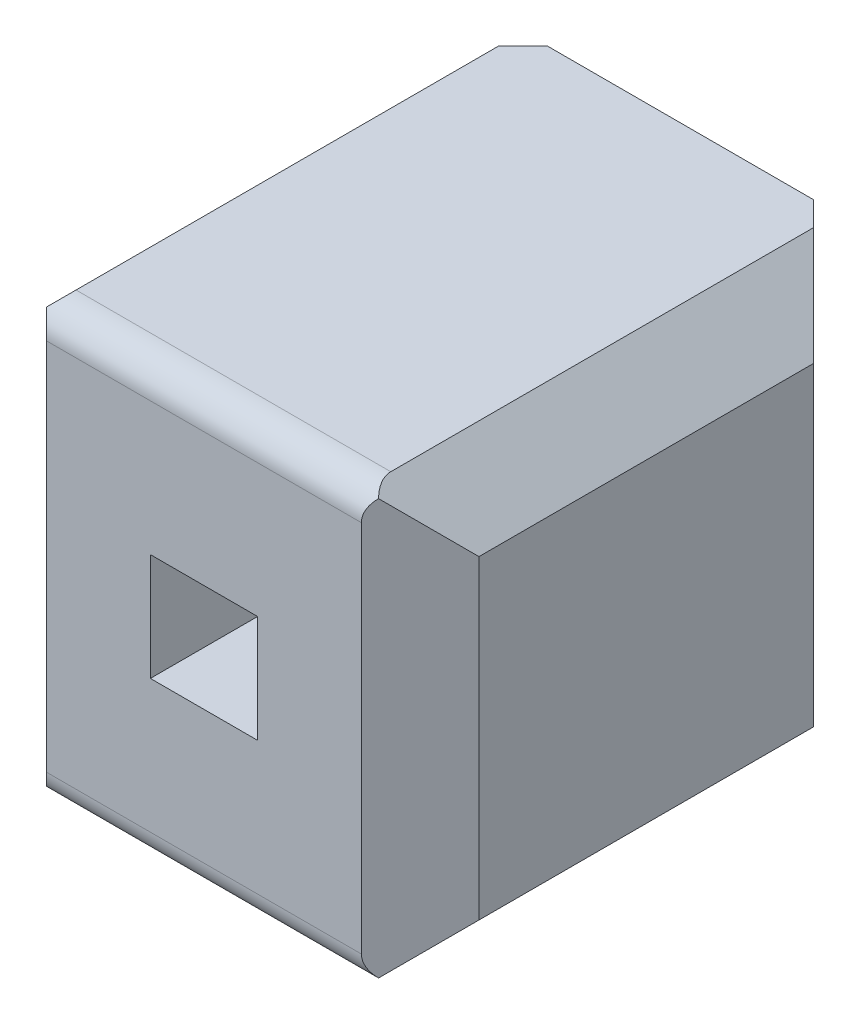
ISO-10303-21;
HEADER;
FILE_DESCRIPTION(('STEP AP214'),'2;1');
FILE_NAME('part.step','',(''),(''),'','','');
FILE_SCHEMA(('AUTOMOTIVE_DESIGN { 1 0 10303 214 1 1 1 1 }'));
ENDSEC;
DATA;
#1=APPLICATION_CONTEXT('core data for automotive mechanical design processes');
#2=APPLICATION_PROTOCOL_DEFINITION('international standard','automotive_design',2000,#1);
#3=PRODUCT_CONTEXT('',#1,'mechanical');
#4=PRODUCT('Part','Part','',(#3));
#5=PRODUCT_RELATED_PRODUCT_CATEGORY('part','',(#4));
#6=PRODUCT_DEFINITION_FORMATION('','',#4);
#7=PRODUCT_DEFINITION_CONTEXT('part definition',#1,'design');
#8=PRODUCT_DEFINITION('design','',#6,#7);
#9=PRODUCT_DEFINITION_SHAPE('','',#8);
#10=(LENGTH_UNIT() NAMED_UNIT(*) SI_UNIT(.MILLI.,.METRE.));
#11=(NAMED_UNIT(*) PLANE_ANGLE_UNIT() SI_UNIT($,.RADIAN.));
#12=(NAMED_UNIT(*) SI_UNIT($,.STERADIAN.) SOLID_ANGLE_UNIT());
#13=UNCERTAINTY_MEASURE_WITH_UNIT(LENGTH_MEASURE(1.E-05),#10,'distance_accuracy_value','');
#14=(GEOMETRIC_REPRESENTATION_CONTEXT(3) GLOBAL_UNCERTAINTY_ASSIGNED_CONTEXT((#13)) GLOBAL_UNIT_ASSIGNED_CONTEXT((#10,
#11,#12)) REPRESENTATION_CONTEXT('',''));
#15=CARTESIAN_POINT('',(0.,0.,0.));
#16=DIRECTION('',(0.,0.,1.));
#17=DIRECTION('',(1.,0.,0.));
#18=AXIS2_PLACEMENT_3D('',#15,#16,#17);
#19=CARTESIAN_POINT('',(27.625,0.315,0.00142135623728765));
#20=DIRECTION('',(-1.,0.,0.));
#21=DIRECTION('',(0.,0.,1.));
#22=AXIS2_PLACEMENT_3D('',#19,#20,#21);
#23=PLANE('',#22);
#24=DIRECTION('',(0.,0.,1.));
#25=VECTOR('',#24,1.);
#26=CARTESIAN_POINT('',(27.625,0.315,0.00142135623728765));
#27=LINE('',#26,#25);
#28=CARTESIAN_POINT('',(27.625,0.315,0.299999942712738));
#29=VERTEX_POINT('',#28);
#30=CARTESIAN_POINT('',(27.625,0.315,2.79999982813813));
#31=VERTEX_POINT('',#30);
#32=EDGE_CURVE('E183',#29,#31,#27,.T.);
#33=ORIENTED_EDGE('',*,*,#32,.T.);
#34=DIRECTION('',(0.,1.,0.));
#35=VECTOR('',#34,1.);
#36=CARTESIAN_POINT('',(27.625,0.315,2.79999982813813));
#37=LINE('',#36,#35);
#38=CARTESIAN_POINT('',(27.625,-0.315,2.79999982813813));
#39=VERTEX_POINT('',#38);
#40=EDGE_CURVE('E203',#39,#31,#37,.T.);
#41=ORIENTED_EDGE('',*,*,#40,.F.);
#42=DIRECTION('',(0.,0.,-1.));
#43=VECTOR('',#42,1.);
#44=CARTESIAN_POINT('',(27.625,-0.315,0.00142135623728765));
#45=LINE('',#44,#43);
#46=CARTESIAN_POINT('',(27.625,-0.315,0.299999942712738));
#47=VERTEX_POINT('',#46);
#48=EDGE_CURVE('E329',#39,#47,#45,.T.);
#49=ORIENTED_EDGE('',*,*,#48,.T.);
#50=DIRECTION('',(0.,1.,0.));
#51=VECTOR('',#50,1.);
#52=CARTESIAN_POINT('',(27.625,0.315,0.299999942712738));
#53=LINE('',#52,#51);
#54=EDGE_CURVE('E201',#29,#47,#53,.F.);
#55=ORIENTED_EDGE('',*,*,#54,.F.);
#56=EDGE_LOOP('',(#33,#41,#49,#55));
#57=FACE_BOUND('',#56,.T.);
#58=ADVANCED_FACE('F17',(#57),#23,.F.);
#59=CARTESIAN_POINT('',(0.,-0.769999999999999,0.));
#60=DIRECTION('',(0.,1.,0.));
#61=DIRECTION('',(0.,0.,1.));
#62=AXIS2_PLACEMENT_3D('',#59,#60,#61);
#63=PLANE('',#62);
#64=DIRECTION('',(-0.70710680342565,0.,-0.707106758947445));
#65=VECTOR('',#64,1.);
#66=CARTESIAN_POINT('',(29.019999966526,-0.769999999999999,0.299999947089447));
#67=LINE('',#66,#65);
#68=CARTESIAN_POINT('',(29.0199999716524,-0.769999999999999,0.299999946269632));
#69=VERTEX_POINT('',#68);
#70=CARTESIAN_POINT('',(28.721421368783,-0.769999999999999,0.00142134515805259));
#71=VERTEX_POINT('',#70);
#72=EDGE_CURVE('E198',#69,#71,#67,.T.);
#73=ORIENTED_EDGE('',*,*,#72,.T.);
#74=DIRECTION('',(1.,0.,0.));
#75=VECTOR('',#74,1.);
#76=CARTESIAN_POINT('',(0.,-0.769999999999999,0.00142135670074056));
#77=LINE('',#76,#75);
#78=CARTESIAN_POINT('',(27.1585786242957,-0.769999999999999,0.00142133825672188));
#79=VERTEX_POINT('',#78);
#80=EDGE_CURVE('E174',#71,#79,#77,.F.);
#81=ORIENTED_EDGE('',*,*,#80,.T.);
#82=DIRECTION('',(-0.707106820593545,0.,0.707106741779548));
#83=VECTOR('',#82,1.);
#84=CARTESIAN_POINT('',(27.1585786426215,-0.769999999999999,0.00142135670999323));
#85=LINE('',#84,#83);
#86=CARTESIAN_POINT('',(26.8600000123696,-0.769999999999999,0.299999945593183));
#87=VERTEX_POINT('',#86);
#88=EDGE_CURVE('E87',#79,#87,#85,.T.);
#89=ORIENTED_EDGE('',*,*,#88,.T.);
#90=DIRECTION('',(-1.,0.,0.));
#91=VECTOR('',#90,1.);
#92=CARTESIAN_POINT('',(26.86,-0.769999999999999,0.299999942712738));
#93=LINE('',#92,#91);
#94=EDGE_CURVE('E214',#69,#87,#93,.T.);
#95=ORIENTED_EDGE('',*,*,#94,.F.);
#96=EDGE_LOOP('',(#73,#81,#89,#95));
#97=FACE_BOUND('',#96,.T.);
#98=ADVANCED_FACE('F666',(#97),#63,.T.);
#99=CARTESIAN_POINT('',(0.,0.77,0.));
#100=DIRECTION('',(0.,-1.,0.));
#101=DIRECTION('',(0.,0.,-1.));
#102=AXIS2_PLACEMENT_3D('',#99,#100,#101);
#103=PLANE('',#102);
#104=DIRECTION('',(1.,0.,0.));
#105=VECTOR('',#104,1.);
#106=CARTESIAN_POINT('',(27.1585786437627,0.770000000000002,0.00142135623728812));
#107=LINE('',#106,#105);
#108=CARTESIAN_POINT('',(27.1585786427003,0.770000000000002,0.00142135631607086));
#109=VERTEX_POINT('',#108);
#110=CARTESIAN_POINT('',(28.7214213572809,0.770000000000002,0.00142135631493289));
#111=VERTEX_POINT('',#110);
#112=EDGE_CURVE('E166',#109,#111,#107,.T.);
#113=ORIENTED_EDGE('',*,*,#112,.T.);
#114=DIRECTION('',(0.707106805534601,0.,0.707106756838493));
#115=VECTOR('',#114,1.);
#116=CARTESIAN_POINT('',(28.7214213573562,0.770000000000001,0.00142135670075502));
#117=LINE('',#116,#115);
#118=CARTESIAN_POINT('',(29.0199999683243,0.770000000000001,0.299999947106724));
#119=VERTEX_POINT('',#118);
#120=EDGE_CURVE('E173',#111,#119,#117,.T.);
#121=ORIENTED_EDGE('',*,*,#120,.T.);
#122=DIRECTION('',(-1.,0.,0.));
#123=VECTOR('',#122,1.);
#124=CARTESIAN_POINT('',(26.86,0.770000000000001,0.299999942712738));
#125=LINE('',#124,#123);
#126=CARTESIAN_POINT('',(26.8600000179682,0.770000000000001,0.299999945706975));
#127=VERTEX_POINT('',#126);
#128=EDGE_CURVE('E168',#127,#119,#125,.F.);
#129=ORIENTED_EDGE('',*,*,#128,.F.);
#130=DIRECTION('',(0.707106817021233,0.,-0.70710674535186));
#131=VECTOR('',#130,1.);
#132=CARTESIAN_POINT('',(26.8600000196911,0.770000000000001,0.29999994937771));
#133=LINE('',#132,#131);
#134=EDGE_CURVE('E163',#127,#109,#133,.T.);
#135=ORIENTED_EDGE('',*,*,#134,.T.);
#136=EDGE_LOOP('',(#113,#121,#129,#135));
#137=FACE_BOUND('',#136,.T.);
#138=ADVANCED_FACE('F165',(#137),#103,.T.);
#139=CARTESIAN_POINT('',(27.1585786437627,1.27,0.00142135623728781));
#140=DIRECTION('',(0.,0.,1.));
#141=DIRECTION('',(1.,0.,0.));
#142=AXIS2_PLACEMENT_3D('',#139,#140,#141);
#143=PLANE('',#142);
#144=DIRECTION('',(0.,1.,0.));
#145=VECTOR('',#144,1.);
#146=CARTESIAN_POINT('',(27.1585786426215,1.27,0.00142135623728781));
#147=LINE('',#146,#145);
#148=CARTESIAN_POINT('',(27.1585786059605,1.26999999469478,0.00142133211179305));
#149=VERTEX_POINT('',#148);
#150=EDGE_CURVE('E179',#149,#109,#147,.F.);
#151=ORIENTED_EDGE('',*,*,#150,.F.);
#152=DIRECTION('',(1.,0.,0.));
#153=VECTOR('',#152,1.);
#154=CARTESIAN_POINT('',(0.,1.27,0.00142135670998416));
#155=LINE('',#154,#153);
#156=CARTESIAN_POINT('',(28.7214213573624,1.27,0.00142135655242558));
#157=VERTEX_POINT('',#156);
#158=EDGE_CURVE('E306',#149,#157,#155,.T.);
#159=ORIENTED_EDGE('',*,*,#158,.T.);
#160=DIRECTION('',(0.,1.,0.));
#161=VECTOR('',#160,1.);
#162=CARTESIAN_POINT('',(28.7214213573562,1.27,0.00142135623730672));
#163=LINE('',#162,#161);
#164=EDGE_CURVE('E181',#111,#157,#163,.T.);
#165=ORIENTED_EDGE('',*,*,#164,.F.);
#166=ORIENTED_EDGE('',*,*,#112,.F.);
#167=EDGE_LOOP('',(#151,#159,#165,#166));
#168=FACE_BOUND('',#167,.T.);
#169=ADVANCED_FACE('F177',(#168),#143,.F.);
#170=CARTESIAN_POINT('',(28.255,0.315,0.00142135623728765));
#171=DIRECTION('',(0.,1.,0.));
#172=DIRECTION('',(0.,0.,1.));
#173=AXIS2_PLACEMENT_3D('',#170,#171,#172);
#174=PLANE('',#173);
#175=DIRECTION('',(0.,0.,-1.));
#176=VECTOR('',#175,1.);
#177=CARTESIAN_POINT('',(28.255,0.315,0.00142135623728765));
#178=LINE('',#177,#176);
#179=CARTESIAN_POINT('',(28.255,0.315,0.299999942712738));
#180=VERTEX_POINT('',#179);
#181=CARTESIAN_POINT('',(28.255,0.315,2.79999982813813));
#182=VERTEX_POINT('',#181);
#183=EDGE_CURVE('E449',#180,#182,#178,.F.);
#184=ORIENTED_EDGE('',*,*,#183,.T.);
#185=DIRECTION('',(1.,0.,0.));
#186=VECTOR('',#185,1.);
#187=CARTESIAN_POINT('',(28.255,0.315,2.79999982813813));
#188=LINE('',#187,#186);
#189=EDGE_CURVE('E335',#31,#182,#188,.T.);
#190=ORIENTED_EDGE('',*,*,#189,.F.);
#191=ORIENTED_EDGE('',*,*,#32,.F.);
#192=DIRECTION('',(-1.,0.,0.));
#193=VECTOR('',#192,1.);
#194=CARTESIAN_POINT('',(26.86,0.315,0.299999942712738));
#195=LINE('',#194,#193);
#196=EDGE_CURVE('E323',#180,#29,#195,.T.);
#197=ORIENTED_EDGE('',*,*,#196,.F.);
#198=EDGE_LOOP('',(#184,#190,#191,#197));
#199=FACE_BOUND('',#198,.T.);
#200=ADVANCED_FACE('F483',(#199),#174,.F.);
#201=CARTESIAN_POINT('',(27.625,-0.315,0.00142135623728765));
#202=DIRECTION('',(0.,-1.,0.));
#203=DIRECTION('',(0.,0.,-1.));
#204=AXIS2_PLACEMENT_3D('',#201,#202,#203);
#205=PLANE('',#204);
#206=ORIENTED_EDGE('',*,*,#48,.F.);
#207=DIRECTION('',(1.,0.,0.));
#208=VECTOR('',#207,1.);
#209=CARTESIAN_POINT('',(27.625,-0.315,2.79999982813813));
#210=LINE('',#209,#208);
#211=CARTESIAN_POINT('',(28.255,-0.315,2.79999982813813));
#212=VERTEX_POINT('',#211);
#213=EDGE_CURVE('E332',#212,#39,#210,.F.);
#214=ORIENTED_EDGE('',*,*,#213,.F.);
#215=DIRECTION('',(0.,0.,-1.));
#216=VECTOR('',#215,1.);
#217=CARTESIAN_POINT('',(28.255,-0.315,0.00142135623728765));
#218=LINE('',#217,#216);
#219=CARTESIAN_POINT('',(28.255,-0.315,0.299999942712738));
#220=VERTEX_POINT('',#219);
#221=EDGE_CURVE('E446',#212,#220,#218,.T.);
#222=ORIENTED_EDGE('',*,*,#221,.T.);
#223=DIRECTION('',(-1.,0.,0.));
#224=VECTOR('',#223,1.);
#225=CARTESIAN_POINT('',(26.86,-0.315,0.299999942712738));
#226=LINE('',#225,#224);
#227=EDGE_CURVE('E219',#47,#220,#226,.F.);
#228=ORIENTED_EDGE('',*,*,#227,.F.);
#229=EDGE_LOOP('',(#206,#214,#222,#228));
#230=FACE_BOUND('',#229,.T.);
#231=ADVANCED_FACE('F485',(#230),#205,.F.);
#232=CARTESIAN_POINT('',(26.86,0.77,0.299999942712738));
#233=DIRECTION('',(0.,0.,-1.));
#234=DIRECTION('',(-1.,0.,0.));
#235=AXIS2_PLACEMENT_3D('',#232,#233,#234);
#236=PLANE('',#235);
#237=ORIENTED_EDGE('',*,*,#196,.T.);
#238=ORIENTED_EDGE('',*,*,#54,.T.);
#239=ORIENTED_EDGE('',*,*,#227,.T.);
#240=DIRECTION('',(0.,1.,0.));
#241=VECTOR('',#240,1.);
#242=CARTESIAN_POINT('',(28.255,-0.315,0.299999942712738));
#243=LINE('',#242,#241);
#244=EDGE_CURVE('E242',#220,#180,#243,.T.);
#245=ORIENTED_EDGE('',*,*,#244,.T.);
#246=EDGE_LOOP('',(#237,#238,#239,#245));
#247=FACE_BOUND('',#246,.T.);
#248=ORIENTED_EDGE('',*,*,#128,.T.);
#249=DIRECTION('',(0.,1.,0.));
#250=VECTOR('',#249,1.);
#251=CARTESIAN_POINT('',(29.0199999695662,0.77,0.299999942712738));
#252=LINE('',#251,#250);
#253=EDGE_CURVE('E213',#119,#69,#252,.F.);
#254=ORIENTED_EDGE('',*,*,#253,.T.);
#255=ORIENTED_EDGE('',*,*,#94,.T.);
#256=DIRECTION('',(0.,1.,0.));
#257=VECTOR('',#256,1.);
#258=CARTESIAN_POINT('',(26.860000006513,0.77,0.299999936199644));
#259=LINE('',#258,#257);
#260=EDGE_CURVE('E222',#127,#87,#259,.F.);
#261=ORIENTED_EDGE('',*,*,#260,.F.);
#262=EDGE_LOOP('',(#248,#254,#255,#261));
#263=FACE_BOUND('',#262,.T.);
#264=ADVANCED_FACE('F386',(#247,#263),#236,.T.);
#265=CARTESIAN_POINT('',(0.,1.27,0.));
#266=DIRECTION('',(0.,-1.,0.));
#267=DIRECTION('',(0.,0.,-1.));
#268=AXIS2_PLACEMENT_3D('',#265,#266,#267);
#269=PLANE('',#268);
#270=DIRECTION('',(-1.,0.,0.));
#271=VECTOR('',#270,1.);
#272=CARTESIAN_POINT('',(0.,1.27000000000001,2.62726119206437));
#273=LINE('',#272,#271);
#274=CARTESIAN_POINT('',(28.8645228137834,1.27000000000001,2.62726119206437));
#275=VERTEX_POINT('',#274);
#276=CARTESIAN_POINT('',(27.0154771816978,1.26999999774056,2.62726119206437));
#277=VERTEX_POINT('',#276);
#278=EDGE_CURVE('E79',#275,#277,#273,.T.);
#279=ORIENTED_EDGE('',*,*,#278,.F.);
#280=DIRECTION('',(0.,0.,1.));
#281=VECTOR('',#280,1.);
#282=CARTESIAN_POINT('',(28.8645228137834,1.27,0.));
#283=LINE('',#282,#281);
#284=CARTESIAN_POINT('',(28.8645228187254,1.26999999967235,0.144522775028399));
#285=VERTEX_POINT('',#284);
#286=EDGE_CURVE('E235',#275,#285,#283,.F.);
#287=ORIENTED_EDGE('',*,*,#286,.T.);
#288=DIRECTION('',(0.70710685986908,0.,0.707106702504007));
#289=VECTOR('',#288,1.);
#290=CARTESIAN_POINT('',(28.7214213573562,1.27,0.00142135670075471));
#291=LINE('',#290,#289);
#292=EDGE_CURVE('E271',#157,#285,#291,.T.);
#293=ORIENTED_EDGE('',*,*,#292,.F.);
#294=ORIENTED_EDGE('',*,*,#158,.F.);
#295=DIRECTION('',(-0.707106674586026,0.,0.707106887787053));
#296=VECTOR('',#295,1.);
#297=CARTESIAN_POINT('',(26.67,1.26999998938956,0.489999999999922));
#298=LINE('',#297,#296);
#299=CARTESIAN_POINT('',(27.0154771771789,1.26999999096222,0.144522769244498));
#300=VERTEX_POINT('',#299);
#301=EDGE_CURVE('E189',#300,#149,#298,.F.);
#302=ORIENTED_EDGE('',*,*,#301,.F.);
#303=DIRECTION('',(0.,0.,1.));
#304=VECTOR('',#303,1.);
#305=CARTESIAN_POINT('',(27.0154771771789,1.26999999096222,2.79999982813813));
#306=LINE('',#305,#304);
#307=EDGE_CURVE('E268',#300,#277,#306,.T.);
#308=ORIENTED_EDGE('',*,*,#307,.T.);
#309=EDGE_LOOP('',(#279,#287,#293,#294,#302,#308));
#310=FACE_BOUND('',#309,.T.);
#311=ADVANCED_FACE('F377',(#310),#269,.F.);
#312=CARTESIAN_POINT('',(26.6700000000001,0.924522813783371,2.79999982813813));
#313=DIRECTION('',(0.707106781186561,-0.707106781186534,0.));
#314=DIRECTION('',(0.707106781186534,0.707106781186561,0.));
#315=AXIS2_PLACEMENT_3D('',#312,#313,#314);
#316=PLANE('',#315);
#317=CARTESIAN_POINT('',(26.842738550143,1.09726136392624,2.62726119206437));
#318=DIRECTION('',(0.707106781186561,-0.707106781186534,0.));
#319=DIRECTION('',(-0.707106781186534,-0.707106781186561,0.));
#320=AXIS2_PLACEMENT_3D('',#317,#318,#319);
#321=ELLIPSE('',#320,0.244289321881344,0.172738636073765);
#322=CARTESIAN_POINT('',(26.9648832110836,1.21940602486691,2.74940585300505));
#323=VERTEX_POINT('',#322);
#324=EDGE_CURVE('E20',#277,#323,#321,.T.);
#325=ORIENTED_EDGE('',*,*,#324,.F.);
#326=ORIENTED_EDGE('',*,*,#307,.F.);
#327=DIRECTION('',(0.577350198387347,0.577350236716254,-0.577350372465262));
#328=VECTOR('',#327,1.);
#329=CARTESIAN_POINT('',(26.67,0.924522813783371,0.489999999999922));
#330=LINE('',#329,#328);
#331=CARTESIAN_POINT('',(26.6700000000001,0.924522813783371,0.489999999999897));
#332=VERTEX_POINT('',#331);
#333=EDGE_CURVE('E357',#332,#300,#330,.T.);
#334=ORIENTED_EDGE('',*,*,#333,.F.);
#335=DIRECTION('',(0.,0.,1.));
#336=VECTOR('',#335,1.);
#337=CARTESIAN_POINT('',(26.6700000000001,0.924522813783371,2.79999982813813));
#338=LINE('',#337,#336);
#339=CARTESIAN_POINT('',(26.6700000000001,0.924522813783372,2.45452264192151));
#340=VERTEX_POINT('',#339);
#341=EDGE_CURVE('E291',#332,#340,#338,.T.);
#342=ORIENTED_EDGE('',*,*,#341,.T.);
#343=DIRECTION('',(0.5773502691896,0.577350269189653,0.577350269189625));
#344=VECTOR('',#343,1.);
#345=CARTESIAN_POINT('',(26.6700000000001,0.924522813783372,2.45452264192151));
#346=LINE('',#345,#344);
#347=EDGE_CURVE('E248',#340,#323,#346,.T.);
#348=ORIENTED_EDGE('',*,*,#347,.T.);
#349=EDGE_LOOP('',(#325,#326,#334,#342,#348));
#350=FACE_BOUND('',#349,.T.);
#351=ADVANCED_FACE('F414',(#350),#316,.F.);
#352=CARTESIAN_POINT('',(26.67,0.77,0.489999999999922));
#353=DIRECTION('',(-0.707106887787053,0.,-0.707106674586026));
#354=DIRECTION('',(-0.707106674586026,0.,0.707106887787053));
#355=AXIS2_PLACEMENT_3D('',#352,#353,#354);
#356=PLANE('',#355);
#357=ORIENTED_EDGE('',*,*,#88,.F.);
#358=DIRECTION('',(0.,1.,0.));
#359=VECTOR('',#358,1.);
#360=CARTESIAN_POINT('',(27.1585785692996,0.77,0.00142128338811054));
#361=LINE('',#360,#359);
#362=CARTESIAN_POINT('',(27.1585786059936,-1.27,0.00142132001372528));
#363=VERTEX_POINT('',#362);
#364=EDGE_CURVE('E224',#79,#363,#361,.F.);
#365=ORIENTED_EDGE('',*,*,#364,.T.);
#366=DIRECTION('',(-0.707106674586026,0.,0.707106887787053));
#367=VECTOR('',#366,1.);
#368=CARTESIAN_POINT('',(26.67,-1.27,0.489999999999922));
#369=LINE('',#368,#367);
#370=CARTESIAN_POINT('',(27.015477168438,-1.27,0.144522744783662));
#371=VERTEX_POINT('',#370);
#372=EDGE_CURVE('E270',#363,#371,#369,.T.);
#373=ORIENTED_EDGE('',*,*,#372,.T.);
#374=DIRECTION('',(-0.577350198387348,0.577350236716252,0.577350372465262));
#375=VECTOR('',#374,1.);
#376=CARTESIAN_POINT('',(27.0154771526708,-1.26999998938956,0.144522743163688));
#377=LINE('',#376,#375);
#378=CARTESIAN_POINT('',(26.67,-0.924522813783353,0.489999999999918));
#379=VERTEX_POINT('',#378);
#380=EDGE_CURVE('E353',#371,#379,#377,.T.);
#381=ORIENTED_EDGE('',*,*,#380,.T.);
#382=DIRECTION('',(0.,1.,0.));
#383=VECTOR('',#382,1.);
#384=CARTESIAN_POINT('',(26.6700000000001,-0.77,0.489999999999922));
#385=LINE('',#384,#383);
#386=EDGE_CURVE('E266',#379,#332,#385,.T.);
#387=ORIENTED_EDGE('',*,*,#386,.T.);
#388=ORIENTED_EDGE('',*,*,#333,.T.);
#389=ORIENTED_EDGE('',*,*,#301,.T.);
#390=ORIENTED_EDGE('',*,*,#150,.T.);
#391=ORIENTED_EDGE('',*,*,#134,.F.);
#392=ORIENTED_EDGE('',*,*,#260,.T.);
#393=EDGE_LOOP('',(#357,#365,#373,#381,#387,#388,#389,#390,#391,#392));
#394=FACE_BOUND('',#393,.T.);
#395=ADVANCED_FACE('F186',(#394),#356,.T.);
#396=CARTESIAN_POINT('',(0.,1.09726136392624,2.62726119206437));
#397=DIRECTION('',(-1.,0.,0.));
#398=DIRECTION('',(0.,-1.,0.));
#399=AXIS2_PLACEMENT_3D('',#396,#397,#398);
#400=CYLINDRICAL_SURFACE('',#399,0.172738636073765);
#401=DIRECTION('',(-1.,0.,0.));
#402=VECTOR('',#401,1.);
#403=CARTESIAN_POINT('',(0.,1.09726136392624,2.79999982813813));
#404=LINE('',#403,#402);
#405=CARTESIAN_POINT('',(27.0154771862167,1.09726136392624,2.79999982813813));
#406=VERTEX_POINT('',#405);
#407=CARTESIAN_POINT('',(28.8645228137834,1.09726136392624,2.79999982813813));
#408=VERTEX_POINT('',#407);
#409=EDGE_CURVE('E263',#406,#408,#404,.F.);
#410=ORIENTED_EDGE('',*,*,#409,.T.);
#411=CARTESIAN_POINT('',(29.0372614498572,1.09726136392624,2.62726119206437));
#412=DIRECTION('',(-0.707106781186561,0.,-0.707106781186534));
#413=DIRECTION('',(-0.707106781186534,0.,0.707106781186561));
#414=AXIS2_PLACEMENT_3D('',#411,#412,#413);
#415=ELLIPSE('',#414,0.244289321881344,0.172738636073765);
#416=CARTESIAN_POINT('',(28.9151167889165,1.21940602486691,2.74940585300505));
#417=VERTEX_POINT('',#416);
#418=EDGE_CURVE('E240',#408,#417,#415,.T.);
#419=ORIENTED_EDGE('',*,*,#418,.T.);
#420=CARTESIAN_POINT('',(29.0372614498572,1.09726136392624,2.62726119206437));
#421=DIRECTION('',(-0.707106781186561,-0.707106781186534,0.));
#422=DIRECTION('',(-0.707106781186534,0.707106781186561,0.));
#423=AXIS2_PLACEMENT_3D('',#420,#421,#422);
#424=ELLIPSE('',#423,0.244289321881344,0.172738636073765);
#425=EDGE_CURVE('E233',#417,#275,#424,.T.);
#426=ORIENTED_EDGE('',*,*,#425,.T.);
#427=ORIENTED_EDGE('',*,*,#278,.T.);
#428=ORIENTED_EDGE('',*,*,#324,.T.);
#429=CARTESIAN_POINT('',(26.8427385501429,1.09726136392624,2.62726119206437));
#430=DIRECTION('',(0.707106781186561,0.,-0.707106781186534));
#431=DIRECTION('',(-0.707106781186534,0.,-0.707106781186561));
#432=AXIS2_PLACEMENT_3D('',#429,#430,#431);
#433=ELLIPSE('',#432,0.244289321881344,0.172738636073765);
#434=EDGE_CURVE('E246',#323,#406,#433,.T.);
#435=ORIENTED_EDGE('',*,*,#434,.T.);
#436=EDGE_LOOP('',(#410,#419,#426,#427,#428,#435));
#437=FACE_BOUND('',#436,.T.);
#438=ADVANCED_FACE('F420',(#437),#400,.T.);
#439=CARTESIAN_POINT('',(27.0154771862167,0.,2.79999982813813));
#440=DIRECTION('',(0.707106781186561,0.,-0.707106781186534));
#441=DIRECTION('',(-0.707106781186534,0.,-0.707106781186561));
#442=AXIS2_PLACEMENT_3D('',#439,#440,#441);
#443=PLANE('',#442);
#444=CARTESIAN_POINT('',(26.842738550143,-1.09726136392623,2.62726119206437));
#445=DIRECTION('',(0.707106781186561,0.,-0.707106781186534));
#446=DIRECTION('',(-0.707106781186534,0.,-0.707106781186561));
#447=AXIS2_PLACEMENT_3D('',#444,#445,#446);
#448=ELLIPSE('',#447,0.244289321881344,0.172738636073765);
#449=CARTESIAN_POINT('',(27.0154771862167,-1.09726136392623,2.79999982813813));
#450=VERTEX_POINT('',#449);
#451=CARTESIAN_POINT('',(26.9648832110836,-1.21940602486691,2.74940585300504));
#452=VERTEX_POINT('',#451);
#453=EDGE_CURVE('E243',#450,#452,#448,.T.);
#454=ORIENTED_EDGE('',*,*,#453,.F.);
#455=DIRECTION('',(0.,1.,0.));
#456=VECTOR('',#455,1.);
#457=CARTESIAN_POINT('',(27.0154771862167,0.,2.79999982813813));
#458=LINE('',#457,#456);
#459=EDGE_CURVE('E430',#450,#406,#458,.T.);
#460=ORIENTED_EDGE('',*,*,#459,.T.);
#461=ORIENTED_EDGE('',*,*,#434,.F.);
#462=ORIENTED_EDGE('',*,*,#347,.F.);
#463=DIRECTION('',(0.,1.,0.));
#464=VECTOR('',#463,1.);
#465=CARTESIAN_POINT('',(26.6700000000001,-0.77,2.4545226419215));
#466=LINE('',#465,#464);
#467=CARTESIAN_POINT('',(26.6700000000001,-0.924522813783369,2.45452264192151));
#468=VERTEX_POINT('',#467);
#469=EDGE_CURVE('E340',#340,#468,#466,.F.);
#470=ORIENTED_EDGE('',*,*,#469,.T.);
#471=DIRECTION('',(-0.577350269189607,0.577350269189654,-0.577350269189616));
#472=VECTOR('',#471,1.);
#473=CARTESIAN_POINT('',(26.9648832110836,-1.21940602486691,2.74940585300503));
#474=LINE('',#473,#472);
#475=EDGE_CURVE('E245',#452,#468,#474,.T.);
#476=ORIENTED_EDGE('',*,*,#475,.F.);
#477=EDGE_LOOP('',(#454,#460,#461,#462,#470,#476));
#478=FACE_BOUND('',#477,.T.);
#479=ADVANCED_FACE('F452',(#478),#443,.F.);
#480=CARTESIAN_POINT('',(28.255,-0.315,0.00142135623728765));
#481=DIRECTION('',(1.,0.,0.));
#482=DIRECTION('',(0.,0.,-1.));
#483=AXIS2_PLACEMENT_3D('',#480,#481,#482);
#484=PLANE('',#483);
#485=ORIENTED_EDGE('',*,*,#221,.F.);
#486=DIRECTION('',(0.,1.,0.));
#487=VECTOR('',#486,1.);
#488=CARTESIAN_POINT('',(28.255,0.,2.79999982813813));
#489=LINE('',#488,#487);
#490=EDGE_CURVE('E320',#212,#182,#489,.T.);
#491=ORIENTED_EDGE('',*,*,#490,.T.);
#492=ORIENTED_EDGE('',*,*,#183,.F.);
#493=ORIENTED_EDGE('',*,*,#244,.F.);
#494=EDGE_LOOP('',(#485,#491,#492,#493));
#495=FACE_BOUND('',#494,.T.);
#496=ADVANCED_FACE('F478',(#495),#484,.F.);
#497=CARTESIAN_POINT('',(28.8645228137834,0.,2.79999982813813));
#498=DIRECTION('',(-0.707106781186561,0.,-0.707106781186534));
#499=DIRECTION('',(-0.707106781186534,0.,0.707106781186561));
#500=AXIS2_PLACEMENT_3D('',#497,#498,#499);
#501=PLANE('',#500);
#502=CARTESIAN_POINT('',(29.0372614498572,-1.09726136392623,2.62726119206437));
#503=DIRECTION('',(-0.707106781186561,0.,-0.707106781186534));
#504=DIRECTION('',(-0.707106781186534,0.,0.707106781186561));
#505=AXIS2_PLACEMENT_3D('',#502,#503,#504);
#506=ELLIPSE('',#505,0.244289321881344,0.172738636073765);
#507=CARTESIAN_POINT('',(28.9151167889165,-1.21940602486691,2.74940585300504));
#508=VERTEX_POINT('',#507);
#509=CARTESIAN_POINT('',(28.8645228137834,-1.09726136392623,2.79999982813813));
#510=VERTEX_POINT('',#509);
#511=EDGE_CURVE('E237',#508,#510,#506,.T.);
#512=ORIENTED_EDGE('',*,*,#511,.F.);
#513=DIRECTION('',(-0.577350269189606,-0.577350269189645,0.577350269189627));
#514=VECTOR('',#513,1.);
#515=CARTESIAN_POINT('',(29.21,-0.924522813783369,2.45452264192151));
#516=LINE('',#515,#514);
#517=CARTESIAN_POINT('',(29.21,-0.924522813783372,2.45452264192151));
#518=VERTEX_POINT('',#517);
#519=EDGE_CURVE('E239',#518,#508,#516,.T.);
#520=ORIENTED_EDGE('',*,*,#519,.F.);
#521=DIRECTION('',(0.,1.,0.));
#522=VECTOR('',#521,1.);
#523=CARTESIAN_POINT('',(29.21,1.27,2.45452264192151));
#524=LINE('',#523,#522);
#525=CARTESIAN_POINT('',(29.21,0.92452281378338,2.45452264192151));
#526=VERTEX_POINT('',#525);
#527=EDGE_CURVE('E315',#518,#526,#524,.T.);
#528=ORIENTED_EDGE('',*,*,#527,.T.);
#529=DIRECTION('',(-0.577350269189609,0.57735026918963,0.577350269189639));
#530=VECTOR('',#529,1.);
#531=CARTESIAN_POINT('',(29.21,0.92452281378338,2.45452264192151));
#532=LINE('',#531,#530);
#533=EDGE_CURVE('E236',#526,#417,#532,.T.);
#534=ORIENTED_EDGE('',*,*,#533,.T.);
#535=ORIENTED_EDGE('',*,*,#418,.F.);
#536=DIRECTION('',(0.,1.,0.));
#537=VECTOR('',#536,1.);
#538=CARTESIAN_POINT('',(28.8645228137834,0.,2.79999982813813));
#539=LINE('',#538,#537);
#540=EDGE_CURVE('E265',#408,#510,#539,.F.);
#541=ORIENTED_EDGE('',*,*,#540,.T.);
#542=EDGE_LOOP('',(#512,#520,#528,#534,#535,#541));
#543=FACE_BOUND('',#542,.T.);
#544=ADVANCED_FACE('F424',(#543),#501,.F.);
#545=CARTESIAN_POINT('',(28.8645228137834,1.27,0.));
#546=DIRECTION('',(-0.707106781186561,-0.707106781186534,0.));
#547=DIRECTION('',(0.707106781186534,-0.707106781186561,0.));
#548=AXIS2_PLACEMENT_3D('',#545,#546,#547);
#549=PLANE('',#548);
#550=ORIENTED_EDGE('',*,*,#425,.F.);
#551=ORIENTED_EDGE('',*,*,#533,.F.);
#552=DIRECTION('',(0.,0.,1.));
#553=VECTOR('',#552,1.);
#554=CARTESIAN_POINT('',(29.21,0.924522813783374,2.79999982813813));
#555=LINE('',#554,#553);
#556=CARTESIAN_POINT('',(29.21,0.924522813783377,0.489999999999929));
#557=VERTEX_POINT('',#556);
#558=EDGE_CURVE('E298',#526,#557,#555,.F.);
#559=ORIENTED_EDGE('',*,*,#558,.T.);
#560=DIRECTION('',(0.577350224938269,-0.577350248893808,0.577350333736795));
#561=VECTOR('',#560,1.);
#562=CARTESIAN_POINT('',(28.8645228347495,1.26999999336848,0.144522769646125));
#563=LINE('',#562,#561);
#564=EDGE_CURVE('E277',#285,#557,#563,.T.);
#565=ORIENTED_EDGE('',*,*,#564,.F.);
#566=ORIENTED_EDGE('',*,*,#286,.F.);
#567=EDGE_LOOP('',(#550,#551,#559,#565,#566));
#568=FACE_BOUND('',#567,.T.);
#569=ADVANCED_FACE('F417',(#568),#549,.F.);
#570=CARTESIAN_POINT('',(29.0199999785173,0.77,0.299999942712738));
#571=DIRECTION('',(0.707106847811761,0.,-0.707106714561327));
#572=DIRECTION('',(-0.707106714561327,0.,-0.707106847811761));
#573=AXIS2_PLACEMENT_3D('',#570,#571,#572);
#574=PLANE('',#573);
#575=ORIENTED_EDGE('',*,*,#120,.F.);
#576=ORIENTED_EDGE('',*,*,#164,.T.);
#577=ORIENTED_EDGE('',*,*,#292,.T.);
#578=ORIENTED_EDGE('',*,*,#564,.T.);
#579=DIRECTION('',(0.,1.,0.));
#580=VECTOR('',#579,1.);
#581=CARTESIAN_POINT('',(29.21,1.27,0.489999999999931));
#582=LINE('',#581,#580);
#583=CARTESIAN_POINT('',(29.21,-0.924522813783371,0.489999999999921));
#584=VERTEX_POINT('',#583);
#585=EDGE_CURVE('E294',#557,#584,#582,.F.);
#586=ORIENTED_EDGE('',*,*,#585,.T.);
#587=DIRECTION('',(-0.577350224938271,-0.577350248893804,-0.577350333736796));
#588=VECTOR('',#587,1.);
#589=CARTESIAN_POINT('',(29.21,-0.924522813783371,0.489999999999921));
#590=LINE('',#589,#588);
#591=CARTESIAN_POINT('',(28.8645228277608,-1.26999999557899,0.144522773524421));
#592=VERTEX_POINT('',#591);
#593=EDGE_CURVE('E274',#584,#592,#590,.T.);
#594=ORIENTED_EDGE('',*,*,#593,.T.);
#595=DIRECTION('',(-0.707106714561327,0.,-0.707106847811761));
#596=VECTOR('',#595,1.);
#597=CARTESIAN_POINT('',(29.0199999785173,-1.26999999336848,0.299999942712738));
#598=LINE('',#597,#596);
#599=CARTESIAN_POINT('',(28.7214214030056,-1.26999999336848,0.00142131093550438));
#600=VERTEX_POINT('',#599);
#601=EDGE_CURVE('E276',#592,#600,#598,.T.);
#602=ORIENTED_EDGE('',*,*,#601,.T.);
#603=DIRECTION('',(0.,1.,0.));
#604=VECTOR('',#603,1.);
#605=CARTESIAN_POINT('',(28.7214214030635,0.77,0.00142131099343449));
#606=LINE('',#605,#604);
#607=EDGE_CURVE('E281',#600,#71,#606,.T.);
#608=ORIENTED_EDGE('',*,*,#607,.T.);
#609=ORIENTED_EDGE('',*,*,#72,.F.);
#610=ORIENTED_EDGE('',*,*,#253,.F.);
#611=EDGE_LOOP('',(#575,#576,#577,#578,#586,#594,#602,#608,#609,#610));
#612=FACE_BOUND('',#611,.T.);
#613=ADVANCED_FACE('F382',(#612),#574,.T.);
#614=CARTESIAN_POINT('',(26.6700000000001,-0.77,2.79999982813813));
#615=DIRECTION('',(1.,0.,0.));
#616=DIRECTION('',(0.,1.,0.));
#617=AXIS2_PLACEMENT_3D('',#614,#615,#616);
#618=PLANE('',#617);
#619=DIRECTION('',(0.,0.,1.));
#620=VECTOR('',#619,1.);
#621=CARTESIAN_POINT('',(26.67,-0.924522813783329,0.));
#622=LINE('',#621,#620);
#623=EDGE_CURVE('E297',#379,#468,#622,.T.);
#624=ORIENTED_EDGE('',*,*,#623,.T.);
#625=ORIENTED_EDGE('',*,*,#469,.F.);
#626=ORIENTED_EDGE('',*,*,#341,.F.);
#627=ORIENTED_EDGE('',*,*,#386,.F.);
#628=EDGE_LOOP('',(#624,#625,#626,#627));
#629=FACE_BOUND('',#628,.T.);
#630=ADVANCED_FACE('F410',(#629),#618,.F.);
#631=CARTESIAN_POINT('',(0.,0.,2.79999982813813));
#632=DIRECTION('',(0.,0.,-1.));
#633=DIRECTION('',(-1.,0.,0.));
#634=AXIS2_PLACEMENT_3D('',#631,#632,#633);
#635=PLANE('',#634);
#636=ORIENTED_EDGE('',*,*,#213,.T.);
#637=ORIENTED_EDGE('',*,*,#40,.T.);
#638=ORIENTED_EDGE('',*,*,#189,.T.);
#639=ORIENTED_EDGE('',*,*,#490,.F.);
#640=EDGE_LOOP('',(#636,#637,#638,#639));
#641=FACE_BOUND('',#640,.T.);
#642=DIRECTION('',(-1.,0.,0.));
#643=VECTOR('',#642,1.);
#644=CARTESIAN_POINT('',(0.,-1.09726136392623,2.79999982813814));
#645=LINE('',#644,#643);
#646=EDGE_CURVE('E232',#510,#450,#645,.T.);
#647=ORIENTED_EDGE('',*,*,#646,.F.);
#648=ORIENTED_EDGE('',*,*,#540,.F.);
#649=ORIENTED_EDGE('',*,*,#409,.F.);
#650=ORIENTED_EDGE('',*,*,#459,.F.);
#651=EDGE_LOOP('',(#647,#648,#649,#650));
#652=FACE_BOUND('',#651,.T.);
#653=ADVANCED_FACE('F427',(#641,#652),#635,.F.);
#654=CARTESIAN_POINT('',(29.21,1.27,2.79999982813813));
#655=DIRECTION('',(-1.,0.,0.));
#656=DIRECTION('',(0.,0.,1.));
#657=AXIS2_PLACEMENT_3D('',#654,#655,#656);
#658=PLANE('',#657);
#659=ORIENTED_EDGE('',*,*,#558,.F.);
#660=ORIENTED_EDGE('',*,*,#527,.F.);
#661=DIRECTION('',(0.,0.,1.));
#662=VECTOR('',#661,1.);
#663=CARTESIAN_POINT('',(29.21,-0.924522813783378,0.));
#664=LINE('',#663,#662);
#665=EDGE_CURVE('E229',#518,#584,#664,.F.);
#666=ORIENTED_EDGE('',*,*,#665,.T.);
#667=ORIENTED_EDGE('',*,*,#585,.F.);
#668=EDGE_LOOP('',(#659,#660,#666,#667));
#669=FACE_BOUND('',#668,.T.);
#670=ADVANCED_FACE('F465',(#669),#658,.F.);
#671=CARTESIAN_POINT('',(28.7214213562373,-1.27,0.00142135623729376));
#672=DIRECTION('',(0.,0.,1.));
#673=DIRECTION('',(1.,0.,0.));
#674=AXIS2_PLACEMENT_3D('',#671,#672,#673);
#675=PLANE('',#674);
#676=ORIENTED_EDGE('',*,*,#607,.F.);
#677=DIRECTION('',(1.,0.,0.));
#678=VECTOR('',#677,1.);
#679=CARTESIAN_POINT('',(0.,-1.27,0.00142135670074087));
#680=LINE('',#679,#678);
#681=EDGE_CURVE('E228',#600,#363,#680,.F.);
#682=ORIENTED_EDGE('',*,*,#681,.T.);
#683=ORIENTED_EDGE('',*,*,#364,.F.);
#684=ORIENTED_EDGE('',*,*,#80,.F.);
#685=EDGE_LOOP('',(#676,#682,#683,#684));
#686=FACE_BOUND('',#685,.T.);
#687=ADVANCED_FACE('F394',(#686),#675,.F.);
#688=CARTESIAN_POINT('',(27.0154771862167,-1.27,0.));
#689=DIRECTION('',(0.707106781186559,0.707106781186536,0.));
#690=DIRECTION('',(-0.707106781186536,0.707106781186559,0.));
#691=AXIS2_PLACEMENT_3D('',#688,#689,#690);
#692=PLANE('',#691);
#693=CARTESIAN_POINT('',(26.8427385501429,-1.09726136392623,2.62726119206437));
#694=DIRECTION('',(0.707106781186559,0.707106781186536,0.));
#695=DIRECTION('',(-0.707106781186536,0.707106781186559,0.));
#696=AXIS2_PLACEMENT_3D('',#693,#694,#695);
#697=ELLIPSE('',#696,0.244289321881345,0.172738636073765);
#698=CARTESIAN_POINT('',(27.0154771824841,-1.27,2.62726119206437));
#699=VERTEX_POINT('',#698);
#700=EDGE_CURVE('E230',#452,#699,#697,.T.);
#701=ORIENTED_EDGE('',*,*,#700,.F.);
#702=ORIENTED_EDGE('',*,*,#475,.T.);
#703=ORIENTED_EDGE('',*,*,#623,.F.);
#704=ORIENTED_EDGE('',*,*,#380,.F.);
#705=DIRECTION('',(0.,0.,1.));
#706=VECTOR('',#705,1.);
#707=CARTESIAN_POINT('',(27.0154771787516,-1.27,0.));
#708=LINE('',#707,#706);
#709=EDGE_CURVE('E286',#371,#699,#708,.T.);
#710=ORIENTED_EDGE('',*,*,#709,.T.);
#711=EDGE_LOOP('',(#701,#702,#703,#704,#710));
#712=FACE_BOUND('',#711,.T.);
#713=ADVANCED_FACE('F406',(#712),#692,.F.);
#714=CARTESIAN_POINT('',(0.,-1.09726136392623,2.62726119206437));
#715=DIRECTION('',(-1.,0.,0.));
#716=DIRECTION('',(0.,-1.,0.));
#717=AXIS2_PLACEMENT_3D('',#714,#715,#716);
#718=CYLINDRICAL_SURFACE('',#717,0.172738636073765);
#719=DIRECTION('',(1.,0.,0.));
#720=VECTOR('',#719,1.);
#721=CARTESIAN_POINT('',(0.,-1.27,2.62726119206437));
#722=LINE('',#721,#720);
#723=CARTESIAN_POINT('',(28.8645228137834,-1.27,2.62726119206437));
#724=VERTEX_POINT('',#723);
#725=EDGE_CURVE('E26',#699,#724,#722,.T.);
#726=ORIENTED_EDGE('',*,*,#725,.T.);
#727=CARTESIAN_POINT('',(29.0372614498572,-1.09726136392623,2.62726119206437));
#728=DIRECTION('',(-0.707106781186561,0.707106781186534,0.));
#729=DIRECTION('',(-0.707106781186534,-0.707106781186561,0.));
#730=AXIS2_PLACEMENT_3D('',#727,#728,#729);
#731=ELLIPSE('',#730,0.244289321881344,0.172738636073765);
#732=EDGE_CURVE('E34',#724,#508,#731,.T.);
#733=ORIENTED_EDGE('',*,*,#732,.T.);
#734=ORIENTED_EDGE('',*,*,#511,.T.);
#735=ORIENTED_EDGE('',*,*,#646,.T.);
#736=ORIENTED_EDGE('',*,*,#453,.T.);
#737=ORIENTED_EDGE('',*,*,#700,.T.);
#738=EDGE_LOOP('',(#726,#733,#734,#735,#736,#737));
#739=FACE_BOUND('',#738,.T.);
#740=ADVANCED_FACE('F454',(#739),#718,.T.);
#741=CARTESIAN_POINT('',(28.8645228137834,-1.27,0.));
#742=DIRECTION('',(-0.707106781186561,0.707106781186534,0.));
#743=DIRECTION('',(-0.707106781186534,-0.707106781186561,0.));
#744=AXIS2_PLACEMENT_3D('',#741,#742,#743);
#745=PLANE('',#744);
#746=ORIENTED_EDGE('',*,*,#732,.F.);
#747=DIRECTION('',(0.,0.,1.));
#748=VECTOR('',#747,1.);
#749=CARTESIAN_POINT('',(28.8645228137834,-1.27,0.));
#750=LINE('',#749,#748);
#751=EDGE_CURVE('E11',#724,#592,#750,.F.);
#752=ORIENTED_EDGE('',*,*,#751,.T.);
#753=ORIENTED_EDGE('',*,*,#593,.F.);
#754=ORIENTED_EDGE('',*,*,#665,.F.);
#755=ORIENTED_EDGE('',*,*,#519,.T.);
#756=EDGE_LOOP('',(#746,#752,#753,#754,#755));
#757=FACE_BOUND('',#756,.T.);
#758=ADVANCED_FACE('F461',(#757),#745,.F.);
#759=CARTESIAN_POINT('',(0.,-1.27,0.));
#760=DIRECTION('',(0.,1.,0.));
#761=DIRECTION('',(0.,0.,1.));
#762=AXIS2_PLACEMENT_3D('',#759,#760,#761);
#763=PLANE('',#762);
#764=ORIENTED_EDGE('',*,*,#725,.F.);
#765=ORIENTED_EDGE('',*,*,#709,.F.);
#766=ORIENTED_EDGE('',*,*,#372,.F.);
#767=ORIENTED_EDGE('',*,*,#681,.F.);
#768=ORIENTED_EDGE('',*,*,#601,.F.);
#769=ORIENTED_EDGE('',*,*,#751,.F.);
#770=EDGE_LOOP('',(#764,#765,#766,#767,#768,#769));
#771=FACE_BOUND('',#770,.T.);
#772=ADVANCED_FACE('F398',(#771),#763,.F.);
#773=CLOSED_SHELL('',(#58,#98,#138,#169,#200,#231,#264,#311,#351,#395,#438,#479,#496,#544,#569,
#613,#630,#653,#670,#687,#713,#740,#758,#772));
#774=MANIFOLD_SOLID_BREP('B1',#773);
#775=ADVANCED_BREP_SHAPE_REPRESENTATION('',(#18,#774),#14);
#776=SHAPE_DEFINITION_REPRESENTATION(#9,#775);
ENDSEC;
END-ISO-10303-21;
